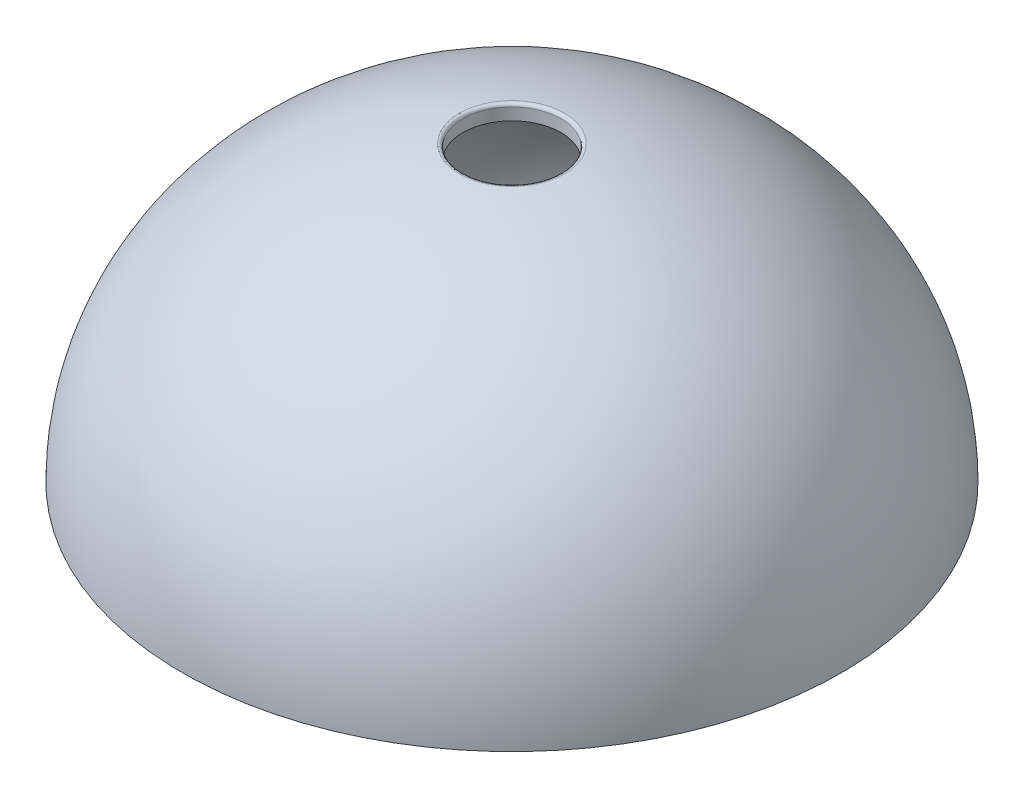
ISO-10303-21;
HEADER;
FILE_DESCRIPTION(('STEP AP214'),'2;1');
FILE_NAME('part.step','',(''),(''),'','','');
FILE_SCHEMA(('AUTOMOTIVE_DESIGN { 1 0 10303 214 1 1 1 1 }'));
ENDSEC;
DATA;
#1=APPLICATION_CONTEXT('core data for automotive mechanical design processes');
#2=APPLICATION_PROTOCOL_DEFINITION('international standard','automotive_design',2000,#1);
#3=PRODUCT_CONTEXT('',#1,'mechanical');
#4=PRODUCT('Part','Part','',(#3));
#5=PRODUCT_RELATED_PRODUCT_CATEGORY('part','',(#4));
#6=PRODUCT_DEFINITION_FORMATION('','',#4);
#7=PRODUCT_DEFINITION_CONTEXT('part definition',#1,'design');
#8=PRODUCT_DEFINITION('design','',#6,#7);
#9=PRODUCT_DEFINITION_SHAPE('','',#8);
#10=(LENGTH_UNIT() NAMED_UNIT(*) SI_UNIT(.MILLI.,.METRE.));
#11=(NAMED_UNIT(*) PLANE_ANGLE_UNIT() SI_UNIT($,.RADIAN.));
#12=(NAMED_UNIT(*) SI_UNIT($,.STERADIAN.) SOLID_ANGLE_UNIT());
#13=UNCERTAINTY_MEASURE_WITH_UNIT(LENGTH_MEASURE(1.E-05),#10,'distance_accuracy_value','');
#14=(GEOMETRIC_REPRESENTATION_CONTEXT(3) GLOBAL_UNCERTAINTY_ASSIGNED_CONTEXT((#13)) GLOBAL_UNIT_ASSIGNED_CONTEXT((#10,
#11,#12)) REPRESENTATION_CONTEXT('',''));
#15=CARTESIAN_POINT('',(0.,0.,0.));
#16=DIRECTION('',(0.,0.,1.));
#17=DIRECTION('',(1.,0.,0.));
#18=AXIS2_PLACEMENT_3D('',#15,#16,#17);
#19=CARTESIAN_POINT('',(0.,0.,0.));
#20=DIRECTION('',(0.,0.,1.));
#21=DIRECTION('',(1.,0.,0.));
#22=AXIS2_PLACEMENT_3D('',#19,#20,#21);
#23=ELLIPSE('',#22,10.75,9.7);
#24=TRIMMED_CURVE('',#23,(PARAMETER_VALUE(-1.5707963267949)),(PARAMETER_VALUE(1.5707963267949)),
.T.,.PARAMETER.);
#25=CARTESIAN_POINT('',(0.,-20.56194023145,0.));
#26=DIRECTION('',(0.,-1.,0.));
#27=AXIS1_PLACEMENT('',#25,#26);
#28=SURFACE_OF_REVOLUTION('',#24,#27);
#29=CARTESIAN_POINT('',(0.,9.57584912973955,0.));
#30=DIRECTION('',(0.,-1.,0.));
#31=DIRECTION('',(0.,0.,-1.));
#32=AXIS2_PLACEMENT_3D('',#29,#30,#31);
#33=CIRCLE('',#32,1.71442453527478);
#34=CARTESIAN_POINT('',(0.,9.57584912973955,-1.71442453527478));
#35=VERTEX_POINT('',#34);
#36=EDGE_CURVE('E37',#35,#35,#33,.T.);
#37=ORIENTED_EDGE('',*,*,#36,.T.);
#38=EDGE_LOOP('',(#37));
#39=FACE_BOUND('',#38,.T.);
#40=CARTESIAN_POINT('',(0.,0.,0.));
#41=DIRECTION('',(0.,-1.,0.));
#42=DIRECTION('',(0.,0.,-1.));
#43=AXIS2_PLACEMENT_3D('',#40,#41,#42);
#44=CIRCLE('',#43,10.75);
#45=CARTESIAN_POINT('',(0.,0.,-10.75));
#46=VERTEX_POINT('',#45);
#47=EDGE_CURVE('E41',#46,#46,#44,.T.);
#48=ORIENTED_EDGE('',*,*,#47,.F.);
#49=EDGE_LOOP('',(#48));
#50=FACE_BOUND('',#49,.T.);
#51=ADVANCED_FACE('F30',(#39,#50),#28,.F.);
#52=CARTESIAN_POINT('',(0.,0.,0.));
#53=DIRECTION('',(0.,0.,1.));
#54=DIRECTION('',(1.,0.,0.));
#55=AXIS2_PLACEMENT_3D('',#52,#53,#54);
#56=ELLIPSE('',#55,10.75,9.7);
#57=TRIMMED_CURVE('',#56,(PARAMETER_VALUE(-1.5707963267949)),(PARAMETER_VALUE(1.5707963267949)),
.T.,.PARAMETER.);
#58=CARTESIAN_POINT('',(0.,-20.56194023145,0.));
#59=DIRECTION('',(0.,-1.,0.));
#60=AXIS1_PLACEMENT('',#58,#59);
#61=SURFACE_OF_REVOLUTION('',#57,#60);
#62=OFFSET_SURFACE('',#61,0.5,.F.);
#63=CARTESIAN_POINT('',(0.,0.,0.));
#64=DIRECTION('',(0.,-1.,0.));
#65=DIRECTION('',(0.,0.,-1.));
#66=AXIS2_PLACEMENT_3D('',#63,#64,#65);
#67=CIRCLE('',#66,10.25);
#68=CARTESIAN_POINT('',(0.,0.,-10.25));
#69=VERTEX_POINT('',#68);
#70=EDGE_CURVE('E45',#69,#69,#67,.T.);
#71=ORIENTED_EDGE('',*,*,#70,.T.);
#72=EDGE_LOOP('',(#71));
#73=FACE_BOUND('',#72,.T.);
#74=CARTESIAN_POINT('',(0.,9.08716303731443,0.));
#75=DIRECTION('',(0.,-1.,0.));
#76=DIRECTION('',(0.,0.,-1.));
#77=AXIS2_PLACEMENT_3D('',#74,#75,#76);
#78=CIRCLE('',#77,1.59999999999999);
#79=CARTESIAN_POINT('',(0.,9.08716303731443,-1.59999999999999));
#80=VERTEX_POINT('',#79);
#81=EDGE_CURVE('E48',#80,#80,#78,.T.);
#82=ORIENTED_EDGE('',*,*,#81,.F.);
#83=EDGE_LOOP('',(#82));
#84=FACE_BOUND('',#83,.T.);
#85=ADVANCED_FACE('F58',(#73,#84),#62,.T.);
#86=CARTESIAN_POINT('',(10.75,0.,0.));
#87=DIRECTION('',(0.,-1.,0.));
#88=DIRECTION('',(0.,0.,-1.));
#89=AXIS2_PLACEMENT_3D('',#86,#87,#88);
#90=PLANE('',#89);
#91=ORIENTED_EDGE('',*,*,#70,.F.);
#92=EDGE_LOOP('',(#91));
#93=FACE_BOUND('',#92,.T.);
#94=ORIENTED_EDGE('',*,*,#47,.T.);
#95=EDGE_LOOP('',(#94));
#96=FACE_BOUND('',#95,.T.);
#97=ADVANCED_FACE('F61',(#93,#96),#90,.T.);
#98=CARTESIAN_POINT('',(0.,0.,0.));
#99=DIRECTION('',(0.,1.,0.));
#100=DIRECTION('',(0.,0.,1.));
#101=AXIS2_PLACEMENT_3D('',#98,#99,#100);
#102=CYLINDRICAL_SURFACE('',#101,1.6);
#103=CARTESIAN_POINT('',(0.,9.47689493436559,0.));
#104=DIRECTION('',(0.,1.,0.));
#105=DIRECTION('',(0.,0.,1.));
#106=AXIS2_PLACEMENT_3D('',#103,#104,#105);
#107=CIRCLE('',#106,1.6);
#108=CARTESIAN_POINT('',(0.,9.47689493436559,1.6));
#109=VERTEX_POINT('',#108);
#110=EDGE_CURVE('E10',#109,#109,#107,.T.);
#111=ORIENTED_EDGE('',*,*,#110,.T.);
#112=EDGE_LOOP('',(#111));
#113=FACE_BOUND('',#112,.T.);
#114=ORIENTED_EDGE('',*,*,#81,.T.);
#115=EDGE_LOOP('',(#114));
#116=FACE_BOUND('',#115,.T.);
#117=ADVANCED_FACE('F63',(#113,#116),#102,.F.);
#118=CARTESIAN_POINT('',(0.,9.47689493436559,0.));
#119=DIRECTION('',(0.,1.,0.));
#120=DIRECTION('',(0.,0.,1.));
#121=AXIS2_PLACEMENT_3D('',#118,#119,#120);
#122=TOROIDAL_SURFACE('',#121,1.7,0.1);
#123=ORIENTED_EDGE('',*,*,#110,.F.);
#124=EDGE_LOOP('',(#123));
#125=FACE_BOUND('',#124,.T.);
#126=ORIENTED_EDGE('',*,*,#36,.F.);
#127=EDGE_LOOP('',(#126));
#128=FACE_BOUND('',#127,.T.);
#129=ADVANCED_FACE('F32',(#125,#128),#122,.T.);
#130=CLOSED_SHELL('',(#51,#85,#97,#117,#129));
#131=MANIFOLD_SOLID_BREP('B2',#130);
#132=ADVANCED_BREP_SHAPE_REPRESENTATION('',(#18,#131),#14);
#133=SHAPE_DEFINITION_REPRESENTATION(#9,#132);
ENDSEC;
END-ISO-10303-21;
